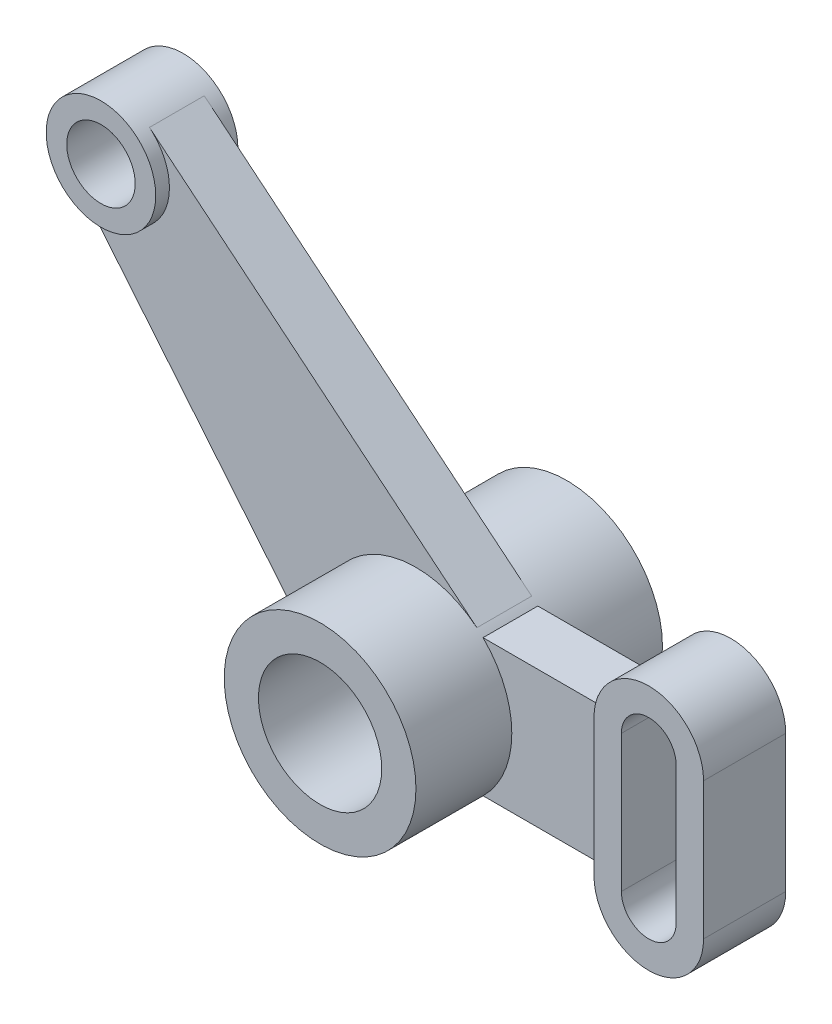
ISO-10303-21;
HEADER;
FILE_DESCRIPTION(('STEP AP214'),'2;1');
FILE_NAME('part.step','',(''),(''),'','','');
FILE_SCHEMA(('AUTOMOTIVE_DESIGN { 1 0 10303 214 1 1 1 1 }'));
ENDSEC;
DATA;
#1=APPLICATION_CONTEXT('core data for automotive mechanical design processes');
#2=APPLICATION_PROTOCOL_DEFINITION('international standard','automotive_design',2000,#1);
#3=PRODUCT_CONTEXT('',#1,'mechanical');
#4=PRODUCT('Part','Part','',(#3));
#5=PRODUCT_RELATED_PRODUCT_CATEGORY('part','',(#4));
#6=PRODUCT_DEFINITION_FORMATION('','',#4);
#7=PRODUCT_DEFINITION_CONTEXT('part definition',#1,'design');
#8=PRODUCT_DEFINITION('design','',#6,#7);
#9=PRODUCT_DEFINITION_SHAPE('','',#8);
#10=(LENGTH_UNIT() NAMED_UNIT(*) SI_UNIT(.MILLI.,.METRE.));
#11=(NAMED_UNIT(*) PLANE_ANGLE_UNIT() SI_UNIT($,.RADIAN.));
#12=(NAMED_UNIT(*) SI_UNIT($,.STERADIAN.) SOLID_ANGLE_UNIT());
#13=UNCERTAINTY_MEASURE_WITH_UNIT(LENGTH_MEASURE(1.E-05),#10,'distance_accuracy_value','');
#14=(GEOMETRIC_REPRESENTATION_CONTEXT(3) GLOBAL_UNCERTAINTY_ASSIGNED_CONTEXT((#13)) GLOBAL_UNIT_ASSIGNED_CONTEXT((#10,
#11,#12)) REPRESENTATION_CONTEXT('',''));
#15=CARTESIAN_POINT('',(0.,0.,0.));
#16=DIRECTION('',(0.,0.,1.));
#17=DIRECTION('',(1.,0.,0.));
#18=AXIS2_PLACEMENT_3D('',#15,#16,#17);
#19=CARTESIAN_POINT('',(70.,0.,15.));
#20=DIRECTION('',(-1.,0.,0.));
#21=DIRECTION('',(0.,-1.,0.));
#22=AXIS2_PLACEMENT_3D('',#19,#20,#21);
#23=PLANE('',#22);
#24=DIRECTION('',(0.,1.,0.));
#25=VECTOR('',#24,1.);
#26=CARTESIAN_POINT('',(70.,0.,-15.));
#27=LINE('',#26,#25);
#28=CARTESIAN_POINT('',(70.,-25.0000000000006,-15.));
#29=VERTEX_POINT('',#28);
#30=CARTESIAN_POINT('',(70.,24.9999999999994,-15.));
#31=VERTEX_POINT('',#30);
#32=EDGE_CURVE('E158',#29,#31,#27,.T.);
#33=ORIENTED_EDGE('',*,*,#32,.F.);
#34=DIRECTION('',(0.,0.,-1.));
#35=VECTOR('',#34,1.);
#36=CARTESIAN_POINT('',(70.,-25.0000000000006,15.));
#37=LINE('',#36,#35);
#38=CARTESIAN_POINT('',(70.,-25.0000000000006,15.));
#39=VERTEX_POINT('',#38);
#40=EDGE_CURVE('E12',#39,#29,#37,.T.);
#41=ORIENTED_EDGE('',*,*,#40,.F.);
#42=DIRECTION('',(0.,1.,0.));
#43=VECTOR('',#42,1.);
#44=CARTESIAN_POINT('',(70.,0.,15.));
#45=LINE('',#44,#43);
#46=CARTESIAN_POINT('',(70.,24.9999999999994,15.));
#47=VERTEX_POINT('',#46);
#48=EDGE_CURVE('E132',#39,#47,#45,.T.);
#49=ORIENTED_EDGE('',*,*,#48,.T.);
#50=DIRECTION('',(0.,0.,-1.));
#51=VECTOR('',#50,1.);
#52=CARTESIAN_POINT('',(70.,24.9999999999994,15.));
#53=LINE('',#52,#51);
#54=EDGE_CURVE('E98',#47,#31,#53,.T.);
#55=ORIENTED_EDGE('',*,*,#54,.T.);
#56=EDGE_LOOP('',(#33,#41,#49,#55));
#57=FACE_BOUND('',#56,.T.);
#58=ADVANCED_FACE('F45',(#57),#23,.T.);
#59=CARTESIAN_POINT('',(90.,-25.0000000000006,15.));
#60=DIRECTION('',(0.,0.,-1.));
#61=DIRECTION('',(-1.,0.,0.));
#62=AXIS2_PLACEMENT_3D('',#59,#60,#61);
#63=CYLINDRICAL_SURFACE('',#62,20.);
#64=CARTESIAN_POINT('',(90.,-25.0000000000006,-15.));
#65=DIRECTION('',(0.,0.,1.));
#66=DIRECTION('',(1.,0.,0.));
#67=AXIS2_PLACEMENT_3D('',#64,#65,#66);
#68=CIRCLE('',#67,20.);
#69=CARTESIAN_POINT('',(110.,-25.0000000000006,-15.));
#70=VERTEX_POINT('',#69);
#71=EDGE_CURVE('E137',#29,#70,#68,.T.);
#72=ORIENTED_EDGE('',*,*,#71,.T.);
#73=DIRECTION('',(0.,0.,-1.));
#74=VECTOR('',#73,1.);
#75=CARTESIAN_POINT('',(110.,-25.0000000000006,15.));
#76=LINE('',#75,#74);
#77=CARTESIAN_POINT('',(110.,-25.0000000000006,15.));
#78=VERTEX_POINT('',#77);
#79=EDGE_CURVE('E55',#78,#70,#76,.T.);
#80=ORIENTED_EDGE('',*,*,#79,.F.);
#81=CARTESIAN_POINT('',(90.,-25.0000000000006,15.));
#82=DIRECTION('',(0.,0.,1.));
#83=DIRECTION('',(1.,0.,0.));
#84=AXIS2_PLACEMENT_3D('',#81,#82,#83);
#85=CIRCLE('',#84,20.);
#86=EDGE_CURVE('E128',#39,#78,#85,.T.);
#87=ORIENTED_EDGE('',*,*,#86,.F.);
#88=ORIENTED_EDGE('',*,*,#40,.T.);
#89=EDGE_LOOP('',(#72,#80,#87,#88));
#90=FACE_BOUND('',#89,.T.);
#91=ADVANCED_FACE('F135',(#90),#63,.T.);
#92=CARTESIAN_POINT('',(110.,0.,15.));
#93=DIRECTION('',(-1.,0.,0.));
#94=DIRECTION('',(0.,0.,1.));
#95=AXIS2_PLACEMENT_3D('',#92,#93,#94);
#96=PLANE('',#95);
#97=DIRECTION('',(0.,1.,0.));
#98=VECTOR('',#97,1.);
#99=CARTESIAN_POINT('',(110.,0.,-15.));
#100=LINE('',#99,#98);
#101=CARTESIAN_POINT('',(110.,24.9999999999994,-15.));
#102=VERTEX_POINT('',#101);
#103=EDGE_CURVE('E155',#70,#102,#100,.T.);
#104=ORIENTED_EDGE('',*,*,#103,.T.);
#105=DIRECTION('',(0.,0.,-1.));
#106=VECTOR('',#105,1.);
#107=CARTESIAN_POINT('',(110.,24.9999999999994,15.));
#108=LINE('',#107,#106);
#109=CARTESIAN_POINT('',(110.,24.9999999999994,15.));
#110=VERTEX_POINT('',#109);
#111=EDGE_CURVE('E127',#110,#102,#108,.T.);
#112=ORIENTED_EDGE('',*,*,#111,.F.);
#113=DIRECTION('',(0.,1.,0.));
#114=VECTOR('',#113,1.);
#115=CARTESIAN_POINT('',(110.,0.,15.));
#116=LINE('',#115,#114);
#117=EDGE_CURVE('E121',#78,#110,#116,.T.);
#118=ORIENTED_EDGE('',*,*,#117,.F.);
#119=ORIENTED_EDGE('',*,*,#79,.T.);
#120=EDGE_LOOP('',(#104,#112,#118,#119));
#121=FACE_BOUND('',#120,.T.);
#122=ADVANCED_FACE('F124',(#121),#96,.F.);
#123=CARTESIAN_POINT('',(90.,24.9999999999994,15.));
#124=DIRECTION('',(0.,0.,-1.));
#125=DIRECTION('',(-1.,0.,0.));
#126=AXIS2_PLACEMENT_3D('',#123,#124,#125);
#127=CYLINDRICAL_SURFACE('',#126,9.99999999999999);
#128=CARTESIAN_POINT('',(90.,24.9999999999994,-15.));
#129=DIRECTION('',(0.,0.,1.));
#130=DIRECTION('',(1.,0.,0.));
#131=AXIS2_PLACEMENT_3D('',#128,#129,#130);
#132=CIRCLE('',#131,9.99999999999999);
#133=CARTESIAN_POINT('',(100.,24.9999999999994,-15.));
#134=VERTEX_POINT('',#133);
#135=CARTESIAN_POINT('',(80.,24.9999999999994,-15.));
#136=VERTEX_POINT('',#135);
#137=EDGE_CURVE('E169',#134,#136,#132,.T.);
#138=ORIENTED_EDGE('',*,*,#137,.F.);
#139=DIRECTION('',(0.,0.,-1.));
#140=VECTOR('',#139,1.);
#141=CARTESIAN_POINT('',(100.,24.9999999999994,15.));
#142=LINE('',#141,#140);
#143=CARTESIAN_POINT('',(100.,24.9999999999994,15.));
#144=VERTEX_POINT('',#143);
#145=EDGE_CURVE('E49',#144,#134,#142,.T.);
#146=ORIENTED_EDGE('',*,*,#145,.F.);
#147=CARTESIAN_POINT('',(90.,24.9999999999994,15.));
#148=DIRECTION('',(0.,0.,1.));
#149=DIRECTION('',(1.,0.,0.));
#150=AXIS2_PLACEMENT_3D('',#147,#148,#149);
#151=CIRCLE('',#150,9.99999999999999);
#152=CARTESIAN_POINT('',(80.,24.9999999999994,15.));
#153=VERTEX_POINT('',#152);
#154=EDGE_CURVE('E154',#144,#153,#151,.T.);
#155=ORIENTED_EDGE('',*,*,#154,.T.);
#156=DIRECTION('',(0.,0.,-1.));
#157=VECTOR('',#156,1.);
#158=CARTESIAN_POINT('',(80.,24.9999999999994,15.));
#159=LINE('',#158,#157);
#160=EDGE_CURVE('E142',#153,#136,#159,.T.);
#161=ORIENTED_EDGE('',*,*,#160,.T.);
#162=EDGE_LOOP('',(#138,#146,#155,#161));
#163=FACE_BOUND('',#162,.T.);
#164=ADVANCED_FACE('F47',(#163),#127,.F.);
#165=CARTESIAN_POINT('',(100.,0.,15.));
#166=DIRECTION('',(-1.,0.,0.));
#167=DIRECTION('',(0.,-1.,0.));
#168=AXIS2_PLACEMENT_3D('',#165,#166,#167);
#169=PLANE('',#168);
#170=DIRECTION('',(0.,1.,0.));
#171=VECTOR('',#170,1.);
#172=CARTESIAN_POINT('',(100.,0.,-15.));
#173=LINE('',#172,#171);
#174=CARTESIAN_POINT('',(100.,-25.0000000000006,-15.));
#175=VERTEX_POINT('',#174);
#176=EDGE_CURVE('E166',#175,#134,#173,.T.);
#177=ORIENTED_EDGE('',*,*,#176,.F.);
#178=DIRECTION('',(0.,0.,-1.));
#179=VECTOR('',#178,1.);
#180=CARTESIAN_POINT('',(100.,-25.0000000000006,15.));
#181=LINE('',#180,#179);
#182=CARTESIAN_POINT('',(100.,-25.0000000000006,15.));
#183=VERTEX_POINT('',#182);
#184=EDGE_CURVE('E145',#183,#175,#181,.T.);
#185=ORIENTED_EDGE('',*,*,#184,.F.);
#186=DIRECTION('',(0.,1.,0.));
#187=VECTOR('',#186,1.);
#188=CARTESIAN_POINT('',(100.,0.,15.));
#189=LINE('',#188,#187);
#190=EDGE_CURVE('E178',#183,#144,#189,.T.);
#191=ORIENTED_EDGE('',*,*,#190,.T.);
#192=ORIENTED_EDGE('',*,*,#145,.T.);
#193=EDGE_LOOP('',(#177,#185,#191,#192));
#194=FACE_BOUND('',#193,.T.);
#195=ADVANCED_FACE('F185',(#194),#169,.T.);
#196=CARTESIAN_POINT('',(90.,-25.0000000000006,15.));
#197=DIRECTION('',(0.,0.,-1.));
#198=DIRECTION('',(-1.,0.,0.));
#199=AXIS2_PLACEMENT_3D('',#196,#197,#198);
#200=CYLINDRICAL_SURFACE('',#199,9.99999999999999);
#201=CARTESIAN_POINT('',(90.,-25.0000000000006,-15.));
#202=DIRECTION('',(0.,0.,1.));
#203=DIRECTION('',(1.,0.,0.));
#204=AXIS2_PLACEMENT_3D('',#201,#202,#203);
#205=CIRCLE('',#204,9.99999999999999);
#206=CARTESIAN_POINT('',(80.,-25.0000000000006,-15.));
#207=VERTEX_POINT('',#206);
#208=EDGE_CURVE('E163',#207,#175,#205,.T.);
#209=ORIENTED_EDGE('',*,*,#208,.F.);
#210=DIRECTION('',(0.,0.,-1.));
#211=VECTOR('',#210,1.);
#212=CARTESIAN_POINT('',(80.,-25.0000000000006,15.));
#213=LINE('',#212,#211);
#214=CARTESIAN_POINT('',(80.,-25.0000000000006,15.));
#215=VERTEX_POINT('',#214);
#216=EDGE_CURVE('E144',#215,#207,#213,.T.);
#217=ORIENTED_EDGE('',*,*,#216,.F.);
#218=CARTESIAN_POINT('',(90.,-25.0000000000006,15.));
#219=DIRECTION('',(0.,0.,1.));
#220=DIRECTION('',(1.,0.,0.));
#221=AXIS2_PLACEMENT_3D('',#218,#219,#220);
#222=CIRCLE('',#221,9.99999999999999);
#223=EDGE_CURVE('E176',#215,#183,#222,.T.);
#224=ORIENTED_EDGE('',*,*,#223,.T.);
#225=ORIENTED_EDGE('',*,*,#184,.T.);
#226=EDGE_LOOP('',(#209,#217,#224,#225));
#227=FACE_BOUND('',#226,.T.);
#228=ADVANCED_FACE('F189',(#227),#200,.F.);
#229=CARTESIAN_POINT('',(80.,0.,15.));
#230=DIRECTION('',(-1.,0.,0.));
#231=DIRECTION('',(0.,-1.,0.));
#232=AXIS2_PLACEMENT_3D('',#229,#230,#231);
#233=PLANE('',#232);
#234=DIRECTION('',(0.,1.,0.));
#235=VECTOR('',#234,1.);
#236=CARTESIAN_POINT('',(80.,0.,-15.));
#237=LINE('',#236,#235);
#238=EDGE_CURVE('E160',#207,#136,#237,.T.);
#239=ORIENTED_EDGE('',*,*,#238,.T.);
#240=ORIENTED_EDGE('',*,*,#160,.F.);
#241=DIRECTION('',(0.,1.,0.));
#242=VECTOR('',#241,1.);
#243=CARTESIAN_POINT('',(80.,0.,15.));
#244=LINE('',#243,#242);
#245=EDGE_CURVE('E174',#215,#153,#244,.T.);
#246=ORIENTED_EDGE('',*,*,#245,.F.);
#247=ORIENTED_EDGE('',*,*,#216,.T.);
#248=EDGE_LOOP('',(#239,#240,#246,#247));
#249=FACE_BOUND('',#248,.T.);
#250=ADVANCED_FACE('F191',(#249),#233,.F.);
#251=CARTESIAN_POINT('',(90.,24.9999999999994,15.));
#252=DIRECTION('',(0.,0.,-1.));
#253=DIRECTION('',(-1.,0.,0.));
#254=AXIS2_PLACEMENT_3D('',#251,#252,#253);
#255=CYLINDRICAL_SURFACE('',#254,20.);
#256=CARTESIAN_POINT('',(90.,24.9999999999994,-15.));
#257=DIRECTION('',(0.,0.,1.));
#258=DIRECTION('',(1.,0.,0.));
#259=AXIS2_PLACEMENT_3D('',#256,#257,#258);
#260=CIRCLE('',#259,20.);
#261=EDGE_CURVE('E91',#102,#31,#260,.T.);
#262=ORIENTED_EDGE('',*,*,#261,.T.);
#263=ORIENTED_EDGE('',*,*,#54,.F.);
#264=CARTESIAN_POINT('',(90.,24.9999999999994,15.));
#265=DIRECTION('',(0.,0.,1.));
#266=DIRECTION('',(1.,0.,0.));
#267=AXIS2_PLACEMENT_3D('',#264,#265,#266);
#268=CIRCLE('',#267,20.);
#269=EDGE_CURVE('E64',#110,#47,#268,.T.);
#270=ORIENTED_EDGE('',*,*,#269,.F.);
#271=ORIENTED_EDGE('',*,*,#111,.T.);
#272=EDGE_LOOP('',(#262,#263,#270,#271));
#273=FACE_BOUND('',#272,.T.);
#274=ADVANCED_FACE('F193',(#273),#255,.T.);
#275=CARTESIAN_POINT('',(0.,0.,15.));
#276=DIRECTION('',(0.,0.,1.));
#277=DIRECTION('',(1.,0.,0.));
#278=AXIS2_PLACEMENT_3D('',#275,#276,#277);
#279=PLANE('',#278);
#280=ORIENTED_EDGE('',*,*,#154,.F.);
#281=ORIENTED_EDGE('',*,*,#190,.F.);
#282=ORIENTED_EDGE('',*,*,#223,.F.);
#283=ORIENTED_EDGE('',*,*,#245,.T.);
#284=EDGE_LOOP('',(#280,#281,#282,#283));
#285=FACE_BOUND('',#284,.T.);
#286=ORIENTED_EDGE('',*,*,#48,.F.);
#287=ORIENTED_EDGE('',*,*,#86,.T.);
#288=ORIENTED_EDGE('',*,*,#117,.T.);
#289=ORIENTED_EDGE('',*,*,#269,.T.);
#290=EDGE_LOOP('',(#286,#287,#288,#289));
#291=FACE_BOUND('',#290,.T.);
#292=ADVANCED_FACE('F131',(#285,#291),#279,.T.);
#293=CARTESIAN_POINT('',(0.,0.,-15.));
#294=DIRECTION('',(0.,0.,1.));
#295=DIRECTION('',(1.,0.,0.));
#296=AXIS2_PLACEMENT_3D('',#293,#294,#295);
#297=PLANE('',#296);
#298=ORIENTED_EDGE('',*,*,#137,.T.);
#299=ORIENTED_EDGE('',*,*,#238,.F.);
#300=ORIENTED_EDGE('',*,*,#208,.T.);
#301=ORIENTED_EDGE('',*,*,#176,.T.);
#302=EDGE_LOOP('',(#298,#299,#300,#301));
#303=FACE_BOUND('',#302,.T.);
#304=ORIENTED_EDGE('',*,*,#32,.T.);
#305=ORIENTED_EDGE('',*,*,#261,.F.);
#306=ORIENTED_EDGE('',*,*,#103,.F.);
#307=ORIENTED_EDGE('',*,*,#71,.F.);
#308=EDGE_LOOP('',(#304,#305,#306,#307));
#309=FACE_BOUND('',#308,.T.);
#310=ADVANCED_FACE('F188',(#303,#309),#297,.F.);
#311=CLOSED_SHELL('',(#58,#91,#122,#164,#195,#228,#250,#274,#292,#310));
#312=MANIFOLD_SOLID_BREP('B2',#311);
#313=CARTESIAN_POINT('',(0.,0.,45.));
#314=DIRECTION('',(0.,0.,-1.));
#315=DIRECTION('',(-1.,0.,0.));
#316=AXIS2_PLACEMENT_3D('',#313,#314,#315);
#317=CYLINDRICAL_SURFACE('',#316,22.5);
#318=CARTESIAN_POINT('',(0.,0.,45.));
#319=DIRECTION('',(0.,0.,1.));
#320=DIRECTION('',(1.,0.,0.));
#321=AXIS2_PLACEMENT_3D('',#318,#319,#320);
#322=CIRCLE('',#321,22.5);
#323=CARTESIAN_POINT('',(22.5,0.,45.));
#324=VERTEX_POINT('',#323);
#325=EDGE_CURVE('E283',#324,#324,#322,.T.);
#326=ORIENTED_EDGE('',*,*,#325,.T.);
#327=EDGE_LOOP('',(#326));
#328=FACE_BOUND('',#327,.T.);
#329=CARTESIAN_POINT('',(0.,0.,-45.));
#330=DIRECTION('',(0.,0.,1.));
#331=DIRECTION('',(1.,0.,0.));
#332=AXIS2_PLACEMENT_3D('',#329,#330,#331);
#333=CIRCLE('',#332,22.5);
#334=CARTESIAN_POINT('',(22.5,0.,-45.));
#335=VERTEX_POINT('',#334);
#336=EDGE_CURVE('E421',#335,#335,#333,.T.);
#337=ORIENTED_EDGE('',*,*,#336,.F.);
#338=EDGE_LOOP('',(#337));
#339=FACE_BOUND('',#338,.T.);
#340=ADVANCED_FACE('F275',(#328,#339),#317,.F.);
#341=CARTESIAN_POINT('',(0.,0.,45.));
#342=DIRECTION('',(0.,0.,-1.));
#343=DIRECTION('',(-1.,0.,0.));
#344=AXIS2_PLACEMENT_3D('',#341,#342,#343);
#345=CYLINDRICAL_SURFACE('',#344,35.);
#346=DIRECTION('',(0.,0.,-1.));
#347=VECTOR('',#346,1.);
#348=CARTESIAN_POINT('',(24.4948974278311,-25.0000000000006,10.));
#349=LINE('',#348,#347);
#350=CARTESIAN_POINT('',(24.4948974278311,-25.0000000000006,9.99999999999999));
#351=VERTEX_POINT('',#350);
#352=CARTESIAN_POINT('',(24.4948974278311,-25.0000000000007,-10.));
#353=VERTEX_POINT('',#352);
#354=EDGE_CURVE('E291',#351,#353,#349,.T.);
#355=ORIENTED_EDGE('',*,*,#354,.F.);
#356=CARTESIAN_POINT('',(0.,0.,10.));
#357=DIRECTION('',(0.,0.,1.));
#358=DIRECTION('',(1.,0.,0.));
#359=AXIS2_PLACEMENT_3D('',#356,#357,#358);
#360=CIRCLE('',#359,35.);
#361=CARTESIAN_POINT('',(24.4948974278325,24.9999999999993,9.99999999999999));
#362=VERTEX_POINT('',#361);
#363=EDGE_CURVE('E295',#351,#362,#360,.T.);
#364=ORIENTED_EDGE('',*,*,#363,.T.);
#365=DIRECTION('',(0.,0.,-1.));
#366=VECTOR('',#365,1.);
#367=CARTESIAN_POINT('',(24.4948974278325,24.9999999999993,10.));
#368=LINE('',#367,#366);
#369=CARTESIAN_POINT('',(24.4948974278325,24.9999999999993,-10.));
#370=VERTEX_POINT('',#369);
#371=EDGE_CURVE('E365',#362,#370,#368,.T.);
#372=ORIENTED_EDGE('',*,*,#371,.T.);
#373=CARTESIAN_POINT('',(0.,0.,-10.));
#374=DIRECTION('',(0.,0.,1.));
#375=DIRECTION('',(1.,0.,0.));
#376=AXIS2_PLACEMENT_3D('',#373,#374,#375);
#377=CIRCLE('',#376,35.);
#378=EDGE_CURVE('E366',#353,#370,#377,.T.);
#379=ORIENTED_EDGE('',*,*,#378,.F.);
#380=EDGE_LOOP('',(#355,#364,#372,#379));
#381=FACE_BOUND('',#380,.T.);
#382=DIRECTION('',(0.,0.,-1.));
#383=VECTOR('',#382,1.);
#384=CARTESIAN_POINT('',(22.2470540841853,27.0197813569121,10.));
#385=LINE('',#384,#383);
#386=CARTESIAN_POINT('',(22.2470540841853,27.0197813569121,10.));
#387=VERTEX_POINT('',#386);
#388=CARTESIAN_POINT('',(22.2470540841853,27.0197813569121,-10.));
#389=VERTEX_POINT('',#388);
#390=EDGE_CURVE('E418',#387,#389,#385,.T.);
#391=ORIENTED_EDGE('',*,*,#390,.F.);
#392=CARTESIAN_POINT('',(0.,0.,10.));
#393=DIRECTION('',(0.,0.,1.));
#394=DIRECTION('',(1.,0.,0.));
#395=AXIS2_PLACEMENT_3D('',#392,#393,#394);
#396=CIRCLE('',#395,35.);
#397=CARTESIAN_POINT('',(-27.0197813569125,-22.2470540841848,10.));
#398=VERTEX_POINT('',#397);
#399=EDGE_CURVE('E390',#387,#398,#396,.T.);
#400=ORIENTED_EDGE('',*,*,#399,.T.);
#401=DIRECTION('',(0.,0.,-1.));
#402=VECTOR('',#401,1.);
#403=CARTESIAN_POINT('',(-27.0197813569125,-22.2470540841848,10.));
#404=LINE('',#403,#402);
#405=CARTESIAN_POINT('',(-27.0197813569125,-22.2470540841848,-10.));
#406=VERTEX_POINT('',#405);
#407=EDGE_CURVE('E401',#398,#406,#404,.T.);
#408=ORIENTED_EDGE('',*,*,#407,.T.);
#409=CARTESIAN_POINT('',(0.,0.,-10.));
#410=DIRECTION('',(0.,0.,1.));
#411=DIRECTION('',(1.,0.,0.));
#412=AXIS2_PLACEMENT_3D('',#409,#410,#411);
#413=CIRCLE('',#412,35.);
#414=EDGE_CURVE('E385',#389,#406,#413,.T.);
#415=ORIENTED_EDGE('',*,*,#414,.F.);
#416=EDGE_LOOP('',(#391,#400,#408,#415));
#417=FACE_BOUND('',#416,.T.);
#418=CARTESIAN_POINT('',(0.,0.,45.));
#419=DIRECTION('',(0.,0.,1.));
#420=DIRECTION('',(1.,0.,0.));
#421=AXIS2_PLACEMENT_3D('',#418,#419,#420);
#422=CIRCLE('',#421,35.);
#423=CARTESIAN_POINT('',(35.,0.,45.));
#424=VERTEX_POINT('',#423);
#425=EDGE_CURVE('E43',#424,#424,#422,.T.);
#426=ORIENTED_EDGE('',*,*,#425,.F.);
#427=EDGE_LOOP('',(#426));
#428=FACE_BOUND('',#427,.T.);
#429=CARTESIAN_POINT('',(0.,0.,-45.));
#430=DIRECTION('',(0.,0.,1.));
#431=DIRECTION('',(1.,0.,0.));
#432=AXIS2_PLACEMENT_3D('',#429,#430,#431);
#433=CIRCLE('',#432,35.);
#434=CARTESIAN_POINT('',(35.,0.,-45.));
#435=VERTEX_POINT('',#434);
#436=EDGE_CURVE('E278',#435,#435,#433,.T.);
#437=ORIENTED_EDGE('',*,*,#436,.T.);
#438=EDGE_LOOP('',(#437));
#439=FACE_BOUND('',#438,.T.);
#440=ADVANCED_FACE('F429',(#381,#417,#428,#439),#345,.T.);
#441=CARTESIAN_POINT('',(0.,0.,45.));
#442=DIRECTION('',(0.,0.,1.));
#443=DIRECTION('',(1.,0.,0.));
#444=AXIS2_PLACEMENT_3D('',#441,#442,#443);
#445=PLANE('',#444);
#446=ORIENTED_EDGE('',*,*,#325,.F.);
#447=EDGE_LOOP('',(#446));
#448=FACE_BOUND('',#447,.T.);
#449=ORIENTED_EDGE('',*,*,#425,.T.);
#450=EDGE_LOOP('',(#449));
#451=FACE_BOUND('',#450,.T.);
#452=ADVANCED_FACE('F434',(#448,#451),#445,.T.);
#453=CARTESIAN_POINT('',(0.,0.,-45.));
#454=DIRECTION('',(0.,0.,1.));
#455=DIRECTION('',(1.,0.,0.));
#456=AXIS2_PLACEMENT_3D('',#453,#454,#455);
#457=PLANE('',#456);
#458=ORIENTED_EDGE('',*,*,#336,.T.);
#459=EDGE_LOOP('',(#458));
#460=FACE_BOUND('',#459,.T.);
#461=ORIENTED_EDGE('',*,*,#436,.F.);
#462=EDGE_LOOP('',(#461));
#463=FACE_BOUND('',#462,.T.);
#464=ADVANCED_FACE('F431',(#460,#463),#457,.F.);
#465=CARTESIAN_POINT('',(22.2470540841853,27.0197813569121,10.));
#466=DIRECTION('',(0.635630116691008,0.771993753054631,0.));
#467=DIRECTION('',(-0.771993753054631,0.635630116691008,0.));
#468=AXIS2_PLACEMENT_3D('',#465,#466,#467);
#469=PLANE('',#468);
#470=DIRECTION('',(0.771993753054632,-0.635630116691008,0.));
#471=VECTOR('',#470,1.);
#472=CARTESIAN_POINT('',(22.2470540841853,27.0197813569121,-10.));
#473=LINE('',#472,#471);
#474=CARTESIAN_POINT('',(-97.2873976661798,125.439875061095,-10.));
#475=VERTEX_POINT('',#474);
#476=EDGE_CURVE('E404',#475,#389,#473,.T.);
#477=ORIENTED_EDGE('',*,*,#476,.F.);
#478=DIRECTION('',(0.,0.,-1.));
#479=VECTOR('',#478,1.);
#480=CARTESIAN_POINT('',(-97.2873976661798,125.439875061095,10.));
#481=LINE('',#480,#479);
#482=CARTESIAN_POINT('',(-97.2873976661799,125.439875061095,10.));
#483=VERTEX_POINT('',#482);
#484=EDGE_CURVE('E416',#483,#475,#481,.T.);
#485=ORIENTED_EDGE('',*,*,#484,.F.);
#486=DIRECTION('',(0.771993753054632,-0.635630116691008,0.));
#487=VECTOR('',#486,1.);
#488=CARTESIAN_POINT('',(22.2470540841853,27.0197813569121,10.));
#489=LINE('',#488,#487);
#490=EDGE_CURVE('E392',#483,#387,#489,.T.);
#491=ORIENTED_EDGE('',*,*,#490,.T.);
#492=ORIENTED_EDGE('',*,*,#390,.T.);
#493=EDGE_LOOP('',(#477,#485,#491,#492));
#494=FACE_BOUND('',#493,.T.);
#495=ADVANCED_FACE('F433',(#494),#469,.T.);
#496=CARTESIAN_POINT('',(-27.0197813569125,-22.2470540841848,10.));
#497=DIRECTION('',(0.771993753054642,0.635630116690995,0.));
#498=DIRECTION('',(-0.635630116690995,0.771993753054643,0.));
#499=AXIS2_PLACEMENT_3D('',#496,#497,#498);
#500=PLANE('',#499);
#501=DIRECTION('',(0.635630116690995,-0.771993753054642,0.));
#502=VECTOR('',#501,1.);
#503=CARTESIAN_POINT('',(-27.0197813569125,-22.2470540841848,-10.));
#504=LINE('',#503,#502);
#505=CARTESIAN_POINT('',(-125.439875061093,97.287397666182,-10.));
#506=VERTEX_POINT('',#505);
#507=EDGE_CURVE('E393',#506,#406,#504,.T.);
#508=ORIENTED_EDGE('',*,*,#507,.T.);
#509=ORIENTED_EDGE('',*,*,#407,.F.);
#510=DIRECTION('',(0.635630116690995,-0.771993753054642,0.));
#511=VECTOR('',#510,1.);
#512=CARTESIAN_POINT('',(-27.0197813569125,-22.2470540841848,10.));
#513=LINE('',#512,#511);
#514=CARTESIAN_POINT('',(-125.439875061093,97.287397666182,10.));
#515=VERTEX_POINT('',#514);
#516=EDGE_CURVE('E398',#515,#398,#513,.T.);
#517=ORIENTED_EDGE('',*,*,#516,.F.);
#518=DIRECTION('',(0.,0.,-1.));
#519=VECTOR('',#518,1.);
#520=CARTESIAN_POINT('',(-125.439875061093,97.287397666182,10.));
#521=LINE('',#520,#519);
#522=EDGE_CURVE('E413',#515,#506,#521,.T.);
#523=ORIENTED_EDGE('',*,*,#522,.T.);
#524=EDGE_LOOP('',(#508,#509,#517,#523));
#525=FACE_BOUND('',#524,.T.);
#526=ADVANCED_FACE('F440',(#525),#500,.F.);
#527=CARTESIAN_POINT('',(0.,0.,10.));
#528=DIRECTION('',(0.,0.,1.));
#529=DIRECTION('',(1.,0.,0.));
#530=AXIS2_PLACEMENT_3D('',#527,#528,#529);
#531=PLANE('',#530);
#532=ORIENTED_EDGE('',*,*,#399,.F.);
#533=ORIENTED_EDGE('',*,*,#490,.F.);
#534=CARTESIAN_POINT('',(-110.,110.000000000002,10.));
#535=DIRECTION('',(0.,0.,1.));
#536=DIRECTION('',(1.,0.,0.));
#537=AXIS2_PLACEMENT_3D('',#534,#535,#536);
#538=CIRCLE('',#537,20.);
#539=EDGE_CURVE('E396',#515,#483,#538,.T.);
#540=ORIENTED_EDGE('',*,*,#539,.F.);
#541=ORIENTED_EDGE('',*,*,#516,.T.);
#542=EDGE_LOOP('',(#532,#533,#540,#541));
#543=FACE_BOUND('',#542,.T.);
#544=ADVANCED_FACE('F462',(#543),#531,.T.);
#545=CARTESIAN_POINT('',(0.,0.,-10.));
#546=DIRECTION('',(0.,0.,1.));
#547=DIRECTION('',(1.,0.,0.));
#548=AXIS2_PLACEMENT_3D('',#545,#546,#547);
#549=PLANE('',#548);
#550=ORIENTED_EDGE('',*,*,#414,.T.);
#551=ORIENTED_EDGE('',*,*,#507,.F.);
#552=CARTESIAN_POINT('',(-110.,110.000000000002,-10.));
#553=DIRECTION('',(0.,0.,1.));
#554=DIRECTION('',(1.,0.,0.));
#555=AXIS2_PLACEMENT_3D('',#552,#553,#554);
#556=CIRCLE('',#555,20.);
#557=EDGE_CURVE('E407',#506,#475,#556,.T.);
#558=ORIENTED_EDGE('',*,*,#557,.T.);
#559=ORIENTED_EDGE('',*,*,#476,.T.);
#560=EDGE_LOOP('',(#550,#551,#558,#559));
#561=FACE_BOUND('',#560,.T.);
#562=ADVANCED_FACE('F473',(#561),#549,.F.);
#563=CARTESIAN_POINT('',(-110.,110.000000000002,15.));
#564=DIRECTION('',(0.,0.,-1.));
#565=DIRECTION('',(-1.,0.,0.));
#566=AXIS2_PLACEMENT_3D('',#563,#564,#565);
#567=CYLINDRICAL_SURFACE('',#566,12.5);
#568=CARTESIAN_POINT('',(-110.,110.000000000002,15.));
#569=DIRECTION('',(0.,0.,1.));
#570=DIRECTION('',(1.,0.,0.));
#571=AXIS2_PLACEMENT_3D('',#568,#569,#570);
#572=CIRCLE('',#571,12.5);
#573=CARTESIAN_POINT('',(-97.5,110.000000000002,15.));
#574=VERTEX_POINT('',#573);
#575=EDGE_CURVE('E378',#574,#574,#572,.T.);
#576=ORIENTED_EDGE('',*,*,#575,.T.);
#577=EDGE_LOOP('',(#576));
#578=FACE_BOUND('',#577,.T.);
#579=CARTESIAN_POINT('',(-110.,110.000000000002,-15.));
#580=DIRECTION('',(0.,0.,1.));
#581=DIRECTION('',(1.,0.,0.));
#582=AXIS2_PLACEMENT_3D('',#579,#580,#581);
#583=CIRCLE('',#582,12.5);
#584=CARTESIAN_POINT('',(-97.5,110.000000000002,-15.));
#585=VERTEX_POINT('',#584);
#586=EDGE_CURVE('E377',#585,#585,#583,.T.);
#587=ORIENTED_EDGE('',*,*,#586,.F.);
#588=EDGE_LOOP('',(#587));
#589=FACE_BOUND('',#588,.T.);
#590=ADVANCED_FACE('F475',(#578,#589),#567,.F.);
#591=CARTESIAN_POINT('',(-110.,110.000000000002,15.));
#592=DIRECTION('',(0.,0.,-1.));
#593=DIRECTION('',(-1.,0.,0.));
#594=AXIS2_PLACEMENT_3D('',#591,#592,#593);
#595=CYLINDRICAL_SURFACE('',#594,20.);
#596=ORIENTED_EDGE('',*,*,#539,.T.);
#597=ORIENTED_EDGE('',*,*,#484,.T.);
#598=ORIENTED_EDGE('',*,*,#557,.F.);
#599=ORIENTED_EDGE('',*,*,#522,.F.);
#600=EDGE_LOOP('',(#596,#597,#598,#599));
#601=FACE_BOUND('',#600,.T.);
#602=CARTESIAN_POINT('',(-110.,110.000000000002,15.));
#603=DIRECTION('',(0.,0.,1.));
#604=DIRECTION('',(1.,0.,0.));
#605=AXIS2_PLACEMENT_3D('',#602,#603,#604);
#606=CIRCLE('',#605,20.);
#607=CARTESIAN_POINT('',(-90.,110.000000000002,15.));
#608=VERTEX_POINT('',#607);
#609=EDGE_CURVE('E381',#608,#608,#606,.T.);
#610=ORIENTED_EDGE('',*,*,#609,.F.);
#611=EDGE_LOOP('',(#610));
#612=FACE_BOUND('',#611,.T.);
#613=CARTESIAN_POINT('',(-110.,110.000000000002,-15.));
#614=DIRECTION('',(0.,0.,1.));
#615=DIRECTION('',(1.,0.,0.));
#616=AXIS2_PLACEMENT_3D('',#613,#614,#615);
#617=CIRCLE('',#616,20.);
#618=CARTESIAN_POINT('',(-90.,110.000000000002,-15.));
#619=VERTEX_POINT('',#618);
#620=EDGE_CURVE('E382',#619,#619,#617,.T.);
#621=ORIENTED_EDGE('',*,*,#620,.T.);
#622=EDGE_LOOP('',(#621));
#623=FACE_BOUND('',#622,.T.);
#624=ADVANCED_FACE('F468',(#601,#612,#623),#595,.T.);
#625=CARTESIAN_POINT('',(0.,0.,15.));
#626=DIRECTION('',(0.,0.,1.));
#627=DIRECTION('',(1.,0.,0.));
#628=AXIS2_PLACEMENT_3D('',#625,#626,#627);
#629=PLANE('',#628);
#630=ORIENTED_EDGE('',*,*,#575,.F.);
#631=EDGE_LOOP('',(#630));
#632=FACE_BOUND('',#631,.T.);
#633=ORIENTED_EDGE('',*,*,#609,.T.);
#634=EDGE_LOOP('',(#633));
#635=FACE_BOUND('',#634,.T.);
#636=ADVANCED_FACE('F517',(#632,#635),#629,.T.);
#637=CARTESIAN_POINT('',(0.,0.,-15.));
#638=DIRECTION('',(0.,0.,1.));
#639=DIRECTION('',(1.,0.,0.));
#640=AXIS2_PLACEMENT_3D('',#637,#638,#639);
#641=PLANE('',#640);
#642=ORIENTED_EDGE('',*,*,#586,.T.);
#643=EDGE_LOOP('',(#642));
#644=FACE_BOUND('',#643,.T.);
#645=ORIENTED_EDGE('',*,*,#620,.F.);
#646=EDGE_LOOP('',(#645));
#647=FACE_BOUND('',#646,.T.);
#648=ADVANCED_FACE('F526',(#644,#647),#641,.F.);
#649=CARTESIAN_POINT('',(0.,-25.0000000000007,10.));
#650=DIRECTION('',(0.,-1.,0.));
#651=DIRECTION('',(1.,0.,0.));
#652=AXIS2_PLACEMENT_3D('',#649,#650,#651);
#653=PLANE('',#652);
#654=DIRECTION('',(-1.,0.,0.));
#655=VECTOR('',#654,1.);
#656=CARTESIAN_POINT('',(0.,-25.0000000000007,-10.));
#657=LINE('',#656,#655);
#658=CARTESIAN_POINT('',(70.,-25.0000000000006,-10.));
#659=VERTEX_POINT('',#658);
#660=EDGE_CURVE('E345',#659,#353,#657,.T.);
#661=ORIENTED_EDGE('',*,*,#660,.F.);
#662=DIRECTION('',(0.,0.,-1.));
#663=VECTOR('',#662,1.);
#664=CARTESIAN_POINT('',(70.,-25.0000000000006,10.));
#665=LINE('',#664,#663);
#666=CARTESIAN_POINT('',(70.,-25.0000000000006,10.));
#667=VERTEX_POINT('',#666);
#668=EDGE_CURVE('E339',#667,#659,#665,.T.);
#669=ORIENTED_EDGE('',*,*,#668,.F.);
#670=DIRECTION('',(-1.,0.,0.));
#671=VECTOR('',#670,1.);
#672=CARTESIAN_POINT('',(0.,-25.0000000000007,10.));
#673=LINE('',#672,#671);
#674=EDGE_CURVE('E343',#667,#351,#673,.T.);
#675=ORIENTED_EDGE('',*,*,#674,.T.);
#676=ORIENTED_EDGE('',*,*,#354,.T.);
#677=EDGE_LOOP('',(#661,#669,#675,#676));
#678=FACE_BOUND('',#677,.T.);
#679=ADVANCED_FACE('F341',(#678),#653,.T.);
#680=CARTESIAN_POINT('',(70.,0.,10.));
#681=DIRECTION('',(-1.,0.,0.));
#682=DIRECTION('',(0.,-1.,0.));
#683=AXIS2_PLACEMENT_3D('',#680,#681,#682);
#684=PLANE('',#683);
#685=DIRECTION('',(0.,1.,0.));
#686=VECTOR('',#685,1.);
#687=CARTESIAN_POINT('',(70.,0.,-10.));
#688=LINE('',#687,#686);
#689=CARTESIAN_POINT('',(70.,24.9999999999994,-10.));
#690=VERTEX_POINT('',#689);
#691=EDGE_CURVE('E370',#659,#690,#688,.T.);
#692=ORIENTED_EDGE('',*,*,#691,.T.);
#693=DIRECTION('',(0.,0.,-1.));
#694=VECTOR('',#693,1.);
#695=CARTESIAN_POINT('',(70.,24.9999999999994,10.));
#696=LINE('',#695,#694);
#697=CARTESIAN_POINT('',(70.,24.9999999999994,10.));
#698=VERTEX_POINT('',#697);
#699=EDGE_CURVE('E349',#698,#690,#696,.T.);
#700=ORIENTED_EDGE('',*,*,#699,.F.);
#701=DIRECTION('',(0.,1.,0.));
#702=VECTOR('',#701,1.);
#703=CARTESIAN_POINT('',(70.,0.,10.));
#704=LINE('',#703,#702);
#705=EDGE_CURVE('E352',#667,#698,#704,.T.);
#706=ORIENTED_EDGE('',*,*,#705,.F.);
#707=ORIENTED_EDGE('',*,*,#668,.T.);
#708=EDGE_LOOP('',(#692,#700,#706,#707));
#709=FACE_BOUND('',#708,.T.);
#710=ADVANCED_FACE('F353',(#709),#684,.F.);
#711=CARTESIAN_POINT('',(0.,24.9999999999992,10.));
#712=DIRECTION('',(0.,1.,0.));
#713=DIRECTION('',(-1.,0.,0.));
#714=AXIS2_PLACEMENT_3D('',#711,#712,#713);
#715=PLANE('',#714);
#716=DIRECTION('',(1.,0.,0.));
#717=VECTOR('',#716,1.);
#718=CARTESIAN_POINT('',(0.,24.9999999999992,-10.));
#719=LINE('',#718,#717);
#720=EDGE_CURVE('E361',#370,#690,#719,.T.);
#721=ORIENTED_EDGE('',*,*,#720,.F.);
#722=ORIENTED_EDGE('',*,*,#371,.F.);
#723=DIRECTION('',(1.,0.,0.));
#724=VECTOR('',#723,1.);
#725=CARTESIAN_POINT('',(0.,24.9999999999992,10.));
#726=LINE('',#725,#724);
#727=EDGE_CURVE('E357',#362,#698,#726,.T.);
#728=ORIENTED_EDGE('',*,*,#727,.T.);
#729=ORIENTED_EDGE('',*,*,#699,.T.);
#730=EDGE_LOOP('',(#721,#722,#728,#729));
#731=FACE_BOUND('',#730,.T.);
#732=ADVANCED_FACE('F553',(#731),#715,.T.);
#733=CARTESIAN_POINT('',(0.,0.,10.));
#734=DIRECTION('',(0.,0.,1.));
#735=DIRECTION('',(1.,0.,0.));
#736=AXIS2_PLACEMENT_3D('',#733,#734,#735);
#737=PLANE('',#736);
#738=ORIENTED_EDGE('',*,*,#363,.F.);
#739=ORIENTED_EDGE('',*,*,#674,.F.);
#740=ORIENTED_EDGE('',*,*,#705,.T.);
#741=ORIENTED_EDGE('',*,*,#727,.F.);
#742=EDGE_LOOP('',(#738,#739,#740,#741));
#743=FACE_BOUND('',#742,.T.);
#744=ADVANCED_FACE('F359',(#743),#737,.T.);
#745=CARTESIAN_POINT('',(0.,0.,-10.));
#746=DIRECTION('',(0.,0.,1.));
#747=DIRECTION('',(1.,0.,0.));
#748=AXIS2_PLACEMENT_3D('',#745,#746,#747);
#749=PLANE('',#748);
#750=ORIENTED_EDGE('',*,*,#378,.T.);
#751=ORIENTED_EDGE('',*,*,#720,.T.);
#752=ORIENTED_EDGE('',*,*,#691,.F.);
#753=ORIENTED_EDGE('',*,*,#660,.T.);
#754=EDGE_LOOP('',(#750,#751,#752,#753));
#755=FACE_BOUND('',#754,.T.);
#756=ADVANCED_FACE('F571',(#755),#749,.F.);
#757=CLOSED_SHELL('',(#340,#440,#452,#464,#495,#526,#544,#562,#590,#624,#636,#648,#679,#710,
#732,#744,#756));
#758=MANIFOLD_SOLID_BREP('B6',#757);
#759=ADVANCED_BREP_SHAPE_REPRESENTATION('',(#18,#312,#758),#14);
#760=SHAPE_DEFINITION_REPRESENTATION(#9,#759);
ENDSEC;
END-ISO-10303-21;
